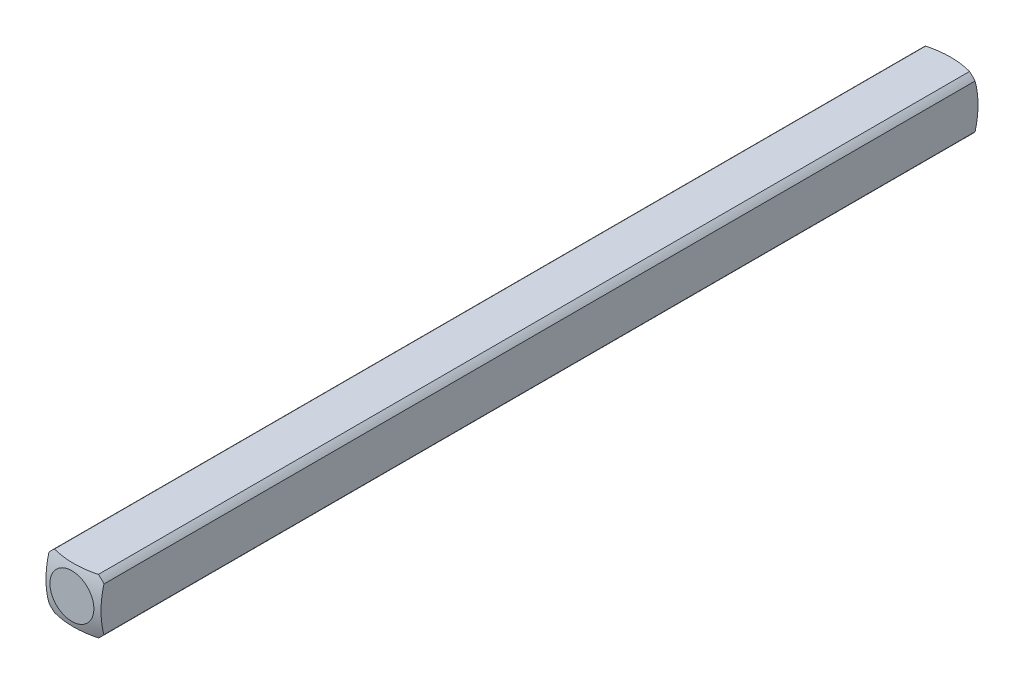
ISO-10303-21;
HEADER;
FILE_DESCRIPTION(('STEP AP214'),'2;1');
FILE_NAME('part.step','',(''),(''),'','','');
FILE_SCHEMA(('AUTOMOTIVE_DESIGN { 1 0 10303 214 1 1 1 1 }'));
ENDSEC;
DATA;
#1=APPLICATION_CONTEXT('core data for automotive mechanical design processes');
#2=APPLICATION_PROTOCOL_DEFINITION('international standard','automotive_design',2000,#1);
#3=PRODUCT_CONTEXT('',#1,'mechanical');
#4=PRODUCT('Part','Part','',(#3));
#5=PRODUCT_RELATED_PRODUCT_CATEGORY('part','',(#4));
#6=PRODUCT_DEFINITION_FORMATION('','',#4);
#7=PRODUCT_DEFINITION_CONTEXT('part definition',#1,'design');
#8=PRODUCT_DEFINITION('design','',#6,#7);
#9=PRODUCT_DEFINITION_SHAPE('','',#8);
#10=(LENGTH_UNIT() NAMED_UNIT(*) SI_UNIT(.MILLI.,.METRE.));
#11=(NAMED_UNIT(*) PLANE_ANGLE_UNIT() SI_UNIT($,.RADIAN.));
#12=(NAMED_UNIT(*) SI_UNIT($,.STERADIAN.) SOLID_ANGLE_UNIT());
#13=UNCERTAINTY_MEASURE_WITH_UNIT(LENGTH_MEASURE(1.E-05),#10,'distance_accuracy_value','');
#14=(GEOMETRIC_REPRESENTATION_CONTEXT(3) GLOBAL_UNCERTAINTY_ASSIGNED_CONTEXT((#13)) GLOBAL_UNIT_ASSIGNED_CONTEXT((#10,
#11,#12)) REPRESENTATION_CONTEXT('',''));
#15=CARTESIAN_POINT('',(0.,0.,0.));
#16=DIRECTION('',(0.,0.,1.));
#17=DIRECTION('',(1.,0.,0.));
#18=AXIS2_PLACEMENT_3D('',#15,#16,#17);
#19=CARTESIAN_POINT('',(-1.5875,-1.5875,25.4));
#20=DIRECTION('',(1.,0.,0.));
#21=DIRECTION('',(0.,0.,-1.));
#22=AXIS2_PLACEMENT_3D('',#19,#20,#21);
#23=PLANE('',#22);
#24=CARTESIAN_POINT('',(-1.5875,0.,4.91912226376204));
#25=DIRECTION('',(1.,0.,0.));
#26=DIRECTION('',(0.,0.,-1.));
#27=AXIS2_PLACEMENT_3D('',#24,#25,#26);
#28=CIRCLE('',#27,4.82558221875869);
#29=CARTESIAN_POINT('',(-1.5875,-1.26841150657032,0.263225357686904));
#30=VERTEX_POINT('',#29);
#31=CARTESIAN_POINT('',(-1.5875,1.26841150657032,0.263225357686903));
#32=VERTEX_POINT('',#31);
#33=EDGE_CURVE('E47',#30,#32,#28,.T.);
#34=ORIENTED_EDGE('',*,*,#33,.F.);
#35=DIRECTION('',(0.,0.,-1.));
#36=VECTOR('',#35,1.);
#37=CARTESIAN_POINT('',(-1.5875,-1.26841150657032,25.4));
#38=LINE('',#37,#36);
#39=CARTESIAN_POINT('',(-1.5875,-1.26841150657032,50.5367746423131));
#40=VERTEX_POINT('',#39);
#41=EDGE_CURVE('E40',#40,#30,#38,.T.);
#42=ORIENTED_EDGE('',*,*,#41,.F.);
#43=CARTESIAN_POINT('',(-1.5875,0.,45.880877736238));
#44=DIRECTION('',(-1.,0.,0.));
#45=DIRECTION('',(0.,0.,1.));
#46=AXIS2_PLACEMENT_3D('',#43,#44,#45);
#47=CIRCLE('',#46,4.82558221875869);
#48=CARTESIAN_POINT('',(-1.5875,1.26841150657032,50.5367746423131));
#49=VERTEX_POINT('',#48);
#50=EDGE_CURVE('E123',#40,#49,#47,.T.);
#51=ORIENTED_EDGE('',*,*,#50,.T.);
#52=DIRECTION('',(0.,0.,-1.));
#53=VECTOR('',#52,1.);
#54=CARTESIAN_POINT('',(-1.5875,1.26841150657032,25.4));
#55=LINE('',#54,#53);
#56=EDGE_CURVE('E111',#32,#49,#55,.F.);
#57=ORIENTED_EDGE('',*,*,#56,.F.);
#58=EDGE_LOOP('',(#34,#42,#51,#57));
#59=FACE_BOUND('',#58,.T.);
#60=ADVANCED_FACE('F33',(#59),#23,.F.);
#61=CARTESIAN_POINT('',(-1.5875,-1.5875,25.4));
#62=DIRECTION('',(0.,1.,0.));
#63=DIRECTION('',(0.,0.,1.));
#64=AXIS2_PLACEMENT_3D('',#61,#62,#63);
#65=PLANE('',#64);
#66=CARTESIAN_POINT('',(0.,-1.5875,4.91912226376204));
#67=DIRECTION('',(0.,1.,0.));
#68=DIRECTION('',(0.,0.,1.));
#69=AXIS2_PLACEMENT_3D('',#66,#67,#68);
#70=CIRCLE('',#69,4.82558221875869);
#71=CARTESIAN_POINT('',(1.26841150657032,-1.5875,0.263225357686905));
#72=VERTEX_POINT('',#71);
#73=CARTESIAN_POINT('',(-1.26841150657032,-1.5875,0.263225357686904));
#74=VERTEX_POINT('',#73);
#75=EDGE_CURVE('E152',#72,#74,#70,.T.);
#76=ORIENTED_EDGE('',*,*,#75,.F.);
#77=DIRECTION('',(0.,0.,-1.));
#78=VECTOR('',#77,1.);
#79=CARTESIAN_POINT('',(1.26841150657032,-1.5875,25.4));
#80=LINE('',#79,#78);
#81=CARTESIAN_POINT('',(1.26841150657032,-1.5875,50.5367746423131));
#82=VERTEX_POINT('',#81);
#83=EDGE_CURVE('E165',#82,#72,#80,.T.);
#84=ORIENTED_EDGE('',*,*,#83,.F.);
#85=CARTESIAN_POINT('',(0.,-1.5875,45.880877736238));
#86=DIRECTION('',(0.,-1.,0.));
#87=DIRECTION('',(0.,0.,-1.));
#88=AXIS2_PLACEMENT_3D('',#85,#86,#87);
#89=CIRCLE('',#88,4.82558221875869);
#90=CARTESIAN_POINT('',(-1.26841150657032,-1.5875,50.5367746423131));
#91=VERTEX_POINT('',#90);
#92=EDGE_CURVE('E134',#82,#91,#89,.T.);
#93=ORIENTED_EDGE('',*,*,#92,.T.);
#94=DIRECTION('',(0.,0.,-1.));
#95=VECTOR('',#94,1.);
#96=CARTESIAN_POINT('',(-1.26841150657032,-1.5875,25.4));
#97=LINE('',#96,#95);
#98=EDGE_CURVE('E163',#74,#91,#97,.F.);
#99=ORIENTED_EDGE('',*,*,#98,.F.);
#100=EDGE_LOOP('',(#76,#84,#93,#99));
#101=FACE_BOUND('',#100,.T.);
#102=ADVANCED_FACE('F175',(#101),#65,.F.);
#103=CARTESIAN_POINT('',(1.5875,-1.5875,25.4));
#104=DIRECTION('',(-1.,0.,0.));
#105=DIRECTION('',(0.,0.,1.));
#106=AXIS2_PLACEMENT_3D('',#103,#104,#105);
#107=PLANE('',#106);
#108=CARTESIAN_POINT('',(1.5875,0.,4.91912226376204));
#109=DIRECTION('',(-1.,0.,0.));
#110=DIRECTION('',(0.,0.,1.));
#111=AXIS2_PLACEMENT_3D('',#108,#109,#110);
#112=CIRCLE('',#111,4.82558221875869);
#113=CARTESIAN_POINT('',(1.5875,1.26841150657032,0.263225357686904));
#114=VERTEX_POINT('',#113);
#115=CARTESIAN_POINT('',(1.5875,-1.26841150657032,0.263225357686904));
#116=VERTEX_POINT('',#115);
#117=EDGE_CURVE('E150',#114,#116,#112,.T.);
#118=ORIENTED_EDGE('',*,*,#117,.F.);
#119=DIRECTION('',(0.,0.,-1.));
#120=VECTOR('',#119,1.);
#121=CARTESIAN_POINT('',(1.5875,1.26841150657032,25.4));
#122=LINE('',#121,#120);
#123=CARTESIAN_POINT('',(1.5875,1.26841150657032,50.5367746423131));
#124=VERTEX_POINT('',#123);
#125=EDGE_CURVE('E160',#124,#114,#122,.T.);
#126=ORIENTED_EDGE('',*,*,#125,.F.);
#127=CARTESIAN_POINT('',(1.5875,0.,45.880877736238));
#128=DIRECTION('',(1.,0.,0.));
#129=DIRECTION('',(0.,0.,-1.));
#130=AXIS2_PLACEMENT_3D('',#127,#128,#129);
#131=CIRCLE('',#130,4.82558221875869);
#132=CARTESIAN_POINT('',(1.5875,-1.26841150657032,50.5367746423131));
#133=VERTEX_POINT('',#132);
#134=EDGE_CURVE('E131',#124,#133,#131,.T.);
#135=ORIENTED_EDGE('',*,*,#134,.T.);
#136=DIRECTION('',(0.,0.,-1.));
#137=VECTOR('',#136,1.);
#138=CARTESIAN_POINT('',(1.5875,-1.26841150657032,25.4));
#139=LINE('',#138,#137);
#140=EDGE_CURVE('E104',#116,#133,#139,.F.);
#141=ORIENTED_EDGE('',*,*,#140,.F.);
#142=EDGE_LOOP('',(#118,#126,#135,#141));
#143=FACE_BOUND('',#142,.T.);
#144=ADVANCED_FACE('F182',(#143),#107,.F.);
#145=CARTESIAN_POINT('',(-1.5875,1.5875,25.4));
#146=DIRECTION('',(0.,-1.,0.));
#147=DIRECTION('',(0.,0.,-1.));
#148=AXIS2_PLACEMENT_3D('',#145,#146,#147);
#149=PLANE('',#148);
#150=CARTESIAN_POINT('',(0.,1.5875,4.91912226376204));
#151=DIRECTION('',(0.,-1.,0.));
#152=DIRECTION('',(0.,0.,-1.));
#153=AXIS2_PLACEMENT_3D('',#150,#151,#152);
#154=CIRCLE('',#153,4.82558221875869);
#155=CARTESIAN_POINT('',(-1.26841150657032,1.5875,0.263225357686904));
#156=VERTEX_POINT('',#155);
#157=CARTESIAN_POINT('',(1.26841150657032,1.5875,0.263225357686904));
#158=VERTEX_POINT('',#157);
#159=EDGE_CURVE('E102',#156,#158,#154,.T.);
#160=ORIENTED_EDGE('',*,*,#159,.F.);
#161=DIRECTION('',(0.,0.,-1.));
#162=VECTOR('',#161,1.);
#163=CARTESIAN_POINT('',(-1.26841150657032,1.5875,25.4));
#164=LINE('',#163,#162);
#165=CARTESIAN_POINT('',(-1.26841150657032,1.5875,50.5367746423131));
#166=VERTEX_POINT('',#165);
#167=EDGE_CURVE('E96',#166,#156,#164,.T.);
#168=ORIENTED_EDGE('',*,*,#167,.F.);
#169=CARTESIAN_POINT('',(0.,1.5875,45.880877736238));
#170=DIRECTION('',(0.,1.,0.));
#171=DIRECTION('',(0.,0.,1.));
#172=AXIS2_PLACEMENT_3D('',#169,#170,#171);
#173=CIRCLE('',#172,4.82558221875869);
#174=CARTESIAN_POINT('',(1.26841150657032,1.5875,50.5367746423131));
#175=VERTEX_POINT('',#174);
#176=EDGE_CURVE('E101',#166,#175,#173,.T.);
#177=ORIENTED_EDGE('',*,*,#176,.T.);
#178=DIRECTION('',(0.,0.,-1.));
#179=VECTOR('',#178,1.);
#180=CARTESIAN_POINT('',(1.26841150657032,1.5875,25.4));
#181=LINE('',#180,#179);
#182=EDGE_CURVE('E105',#158,#175,#181,.F.);
#183=ORIENTED_EDGE('',*,*,#182,.F.);
#184=EDGE_LOOP('',(#160,#168,#177,#183));
#185=FACE_BOUND('',#184,.T.);
#186=ADVANCED_FACE('F98',(#185),#149,.F.);
#187=CARTESIAN_POINT('',(0.,0.,25.4));
#188=DIRECTION('',(0.,0.,-1.));
#189=DIRECTION('',(-1.,0.,0.));
#190=AXIS2_PLACEMENT_3D('',#187,#188,#189);
#191=CYLINDRICAL_SURFACE('',#190,2.032);
#192=ORIENTED_EDGE('',*,*,#41,.T.);
#193=CARTESIAN_POINT('',(0.,0.,0.263225357686904));
#194=DIRECTION('',(0.,0.,1.));
#195=DIRECTION('',(1.,0.,0.));
#196=AXIS2_PLACEMENT_3D('',#193,#194,#195);
#197=CIRCLE('',#196,2.032);
#198=EDGE_CURVE('E147',#30,#74,#197,.T.);
#199=ORIENTED_EDGE('',*,*,#198,.T.);
#200=ORIENTED_EDGE('',*,*,#98,.T.);
#201=CARTESIAN_POINT('',(0.,0.,50.5367746423131));
#202=DIRECTION('',(0.,0.,1.));
#203=DIRECTION('',(1.,0.,0.));
#204=AXIS2_PLACEMENT_3D('',#201,#202,#203);
#205=CIRCLE('',#204,2.032);
#206=EDGE_CURVE('E128',#40,#91,#205,.T.);
#207=ORIENTED_EDGE('',*,*,#206,.F.);
#208=EDGE_LOOP('',(#192,#199,#200,#207));
#209=FACE_BOUND('',#208,.T.);
#210=ADVANCED_FACE('F171',(#209),#191,.T.);
#211=ORIENTED_EDGE('',*,*,#83,.T.);
#212=CARTESIAN_POINT('',(0.,0.,0.263225357686904));
#213=DIRECTION('',(0.,0.,1.));
#214=DIRECTION('',(1.,0.,0.));
#215=AXIS2_PLACEMENT_3D('',#212,#213,#214);
#216=CIRCLE('',#215,2.032);
#217=EDGE_CURVE('E53',#72,#116,#216,.T.);
#218=ORIENTED_EDGE('',*,*,#217,.T.);
#219=ORIENTED_EDGE('',*,*,#140,.T.);
#220=CARTESIAN_POINT('',(0.,0.,50.5367746423131));
#221=DIRECTION('',(0.,0.,1.));
#222=DIRECTION('',(1.,0.,0.));
#223=AXIS2_PLACEMENT_3D('',#220,#221,#222);
#224=CIRCLE('',#223,2.032);
#225=EDGE_CURVE('E137',#82,#133,#224,.T.);
#226=ORIENTED_EDGE('',*,*,#225,.F.);
#227=EDGE_LOOP('',(#211,#218,#219,#226));
#228=FACE_BOUND('',#227,.T.);
#229=ADVANCED_FACE('F178',(#228),#191,.T.);
#230=ORIENTED_EDGE('',*,*,#125,.T.);
#231=CARTESIAN_POINT('',(0.,0.,0.263225357686904));
#232=DIRECTION('',(0.,0.,1.));
#233=DIRECTION('',(1.,0.,0.));
#234=AXIS2_PLACEMENT_3D('',#231,#232,#233);
#235=CIRCLE('',#234,2.032);
#236=EDGE_CURVE('E144',#114,#158,#235,.T.);
#237=ORIENTED_EDGE('',*,*,#236,.T.);
#238=ORIENTED_EDGE('',*,*,#182,.T.);
#239=CARTESIAN_POINT('',(0.,0.,50.5367746423131));
#240=DIRECTION('',(0.,0.,1.));
#241=DIRECTION('',(1.,0.,0.));
#242=AXIS2_PLACEMENT_3D('',#239,#240,#241);
#243=CIRCLE('',#242,2.032);
#244=EDGE_CURVE('E122',#124,#175,#243,.T.);
#245=ORIENTED_EDGE('',*,*,#244,.F.);
#246=EDGE_LOOP('',(#230,#237,#238,#245));
#247=FACE_BOUND('',#246,.T.);
#248=ADVANCED_FACE('F184',(#247),#191,.T.);
#249=ORIENTED_EDGE('',*,*,#167,.T.);
#250=CARTESIAN_POINT('',(0.,0.,0.263225357686904));
#251=DIRECTION('',(0.,0.,1.));
#252=DIRECTION('',(1.,0.,0.));
#253=AXIS2_PLACEMENT_3D('',#250,#251,#252);
#254=CIRCLE('',#253,2.032);
#255=EDGE_CURVE('E12',#156,#32,#254,.T.);
#256=ORIENTED_EDGE('',*,*,#255,.T.);
#257=ORIENTED_EDGE('',*,*,#56,.T.);
#258=CARTESIAN_POINT('',(0.,0.,50.5367746423131));
#259=DIRECTION('',(0.,0.,1.));
#260=DIRECTION('',(1.,0.,0.));
#261=AXIS2_PLACEMENT_3D('',#258,#259,#260);
#262=CIRCLE('',#261,2.032);
#263=EDGE_CURVE('E108',#166,#49,#262,.T.);
#264=ORIENTED_EDGE('',*,*,#263,.F.);
#265=EDGE_LOOP('',(#249,#256,#257,#264));
#266=FACE_BOUND('',#265,.T.);
#267=ADVANCED_FACE('F109',(#266),#191,.T.);
#268=CARTESIAN_POINT('',(0.,0.,4.91912226376204));
#269=DIRECTION('',(0.,0.,1.));
#270=DIRECTION('',(-1.,0.,0.));
#271=AXIS2_PLACEMENT_3D('',#268,#269,#270);
#272=SPHERICAL_SURFACE('',#271,5.08);
#273=CARTESIAN_POINT('',(0.,0.,0.));
#274=DIRECTION('',(0.,0.,-1.));
#275=DIRECTION('',(-1.,0.,0.));
#276=AXIS2_PLACEMENT_3D('',#273,#274,#275);
#277=CIRCLE('',#276,1.26832020963187);
#278=CARTESIAN_POINT('',(-1.26832020963187,0.,0.));
#279=VERTEX_POINT('',#278);
#280=EDGE_CURVE('E155',#279,#279,#277,.T.);
#281=ORIENTED_EDGE('',*,*,#280,.F.);
#282=EDGE_LOOP('',(#281));
#283=FACE_BOUND('',#282,.T.);
#284=ORIENTED_EDGE('',*,*,#75,.T.);
#285=ORIENTED_EDGE('',*,*,#198,.F.);
#286=ORIENTED_EDGE('',*,*,#33,.T.);
#287=ORIENTED_EDGE('',*,*,#255,.F.);
#288=ORIENTED_EDGE('',*,*,#159,.T.);
#289=ORIENTED_EDGE('',*,*,#236,.F.);
#290=ORIENTED_EDGE('',*,*,#117,.T.);
#291=ORIENTED_EDGE('',*,*,#217,.F.);
#292=EDGE_LOOP('',(#284,#285,#286,#287,#288,#289,#290,#291));
#293=FACE_BOUND('',#292,.T.);
#294=ADVANCED_FACE('F185',(#283,#293),#272,.T.);
#295=CARTESIAN_POINT('',(0.,0.,0.));
#296=DIRECTION('',(0.,0.,-1.));
#297=DIRECTION('',(-1.,0.,0.));
#298=AXIS2_PLACEMENT_3D('',#295,#296,#297);
#299=PLANE('',#298);
#300=ORIENTED_EDGE('',*,*,#280,.T.);
#301=EDGE_LOOP('',(#300));
#302=FACE_BOUND('',#301,.T.);
#303=ADVANCED_FACE('F187',(#302),#299,.T.);
#304=CARTESIAN_POINT('',(0.,0.,45.880877736238));
#305=DIRECTION('',(0.,0.,-1.));
#306=DIRECTION('',(-1.,0.,0.));
#307=AXIS2_PLACEMENT_3D('',#304,#305,#306);
#308=SPHERICAL_SURFACE('',#307,5.08);
#309=CARTESIAN_POINT('',(0.,0.,50.8));
#310=DIRECTION('',(0.,0.,-1.));
#311=DIRECTION('',(-1.,0.,0.));
#312=AXIS2_PLACEMENT_3D('',#309,#310,#311);
#313=CIRCLE('',#312,1.26832020963187);
#314=CARTESIAN_POINT('',(-1.26832020963187,0.,50.8));
#315=VERTEX_POINT('',#314);
#316=EDGE_CURVE('E115',#315,#315,#313,.T.);
#317=ORIENTED_EDGE('',*,*,#316,.T.);
#318=EDGE_LOOP('',(#317));
#319=FACE_BOUND('',#318,.T.);
#320=ORIENTED_EDGE('',*,*,#92,.F.);
#321=ORIENTED_EDGE('',*,*,#225,.T.);
#322=ORIENTED_EDGE('',*,*,#134,.F.);
#323=ORIENTED_EDGE('',*,*,#244,.T.);
#324=ORIENTED_EDGE('',*,*,#176,.F.);
#325=ORIENTED_EDGE('',*,*,#263,.T.);
#326=ORIENTED_EDGE('',*,*,#50,.F.);
#327=ORIENTED_EDGE('',*,*,#206,.T.);
#328=EDGE_LOOP('',(#320,#321,#322,#323,#324,#325,#326,#327));
#329=FACE_BOUND('',#328,.T.);
#330=ADVANCED_FACE('F119',(#319,#329),#308,.T.);
#331=CARTESIAN_POINT('',(0.,0.,50.8));
#332=DIRECTION('',(0.,0.,1.));
#333=DIRECTION('',(-1.,0.,0.));
#334=AXIS2_PLACEMENT_3D('',#331,#332,#333);
#335=PLANE('',#334);
#336=ORIENTED_EDGE('',*,*,#316,.F.);
#337=EDGE_LOOP('',(#336));
#338=FACE_BOUND('',#337,.T.);
#339=ADVANCED_FACE('F232',(#338),#335,.T.);
#340=CLOSED_SHELL('',(#60,#102,#144,#186,#210,#229,#248,#267,#294,#303,#330,#339));
#341=MANIFOLD_SOLID_BREP('B2',#340);
#342=ADVANCED_BREP_SHAPE_REPRESENTATION('',(#18,#341),#14);
#343=SHAPE_DEFINITION_REPRESENTATION(#9,#342);
ENDSEC;
END-ISO-10303-21;
